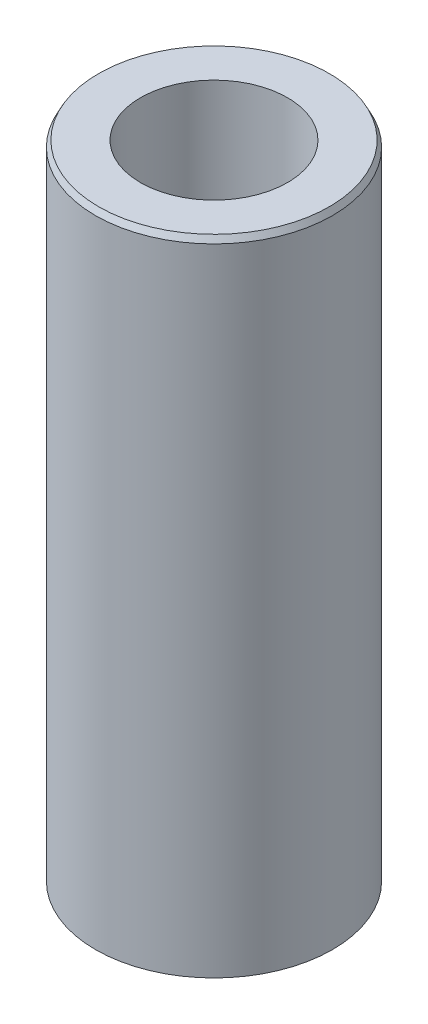
ISO-10303-21;
HEADER;
FILE_DESCRIPTION(('STEP AP214'),'2;1');
FILE_NAME('part.step','',(''),(''),'','','');
FILE_SCHEMA(('AUTOMOTIVE_DESIGN { 1 0 10303 214 1 1 1 1 }'));
ENDSEC;
DATA;
#1=APPLICATION_CONTEXT('core data for automotive mechanical design processes');
#2=APPLICATION_PROTOCOL_DEFINITION('international standard','automotive_design',2000,#1);
#3=PRODUCT_CONTEXT('',#1,'mechanical');
#4=PRODUCT('Part','Part','',(#3));
#5=PRODUCT_RELATED_PRODUCT_CATEGORY('part','',(#4));
#6=PRODUCT_DEFINITION_FORMATION('','',#4);
#7=PRODUCT_DEFINITION_CONTEXT('part definition',#1,'design');
#8=PRODUCT_DEFINITION('design','',#6,#7);
#9=PRODUCT_DEFINITION_SHAPE('','',#8);
#10=(LENGTH_UNIT() NAMED_UNIT(*) SI_UNIT(.MILLI.,.METRE.));
#11=(NAMED_UNIT(*) PLANE_ANGLE_UNIT() SI_UNIT($,.RADIAN.));
#12=(NAMED_UNIT(*) SI_UNIT($,.STERADIAN.) SOLID_ANGLE_UNIT());
#13=UNCERTAINTY_MEASURE_WITH_UNIT(LENGTH_MEASURE(1.E-05),#10,'distance_accuracy_value','');
#14=(GEOMETRIC_REPRESENTATION_CONTEXT(3) GLOBAL_UNCERTAINTY_ASSIGNED_CONTEXT((#13)) GLOBAL_UNIT_ASSIGNED_CONTEXT((#10,
#11,#12)) REPRESENTATION_CONTEXT('',''));
#15=CARTESIAN_POINT('',(0.,0.,0.));
#16=DIRECTION('',(0.,0.,1.));
#17=DIRECTION('',(1.,0.,0.));
#18=AXIS2_PLACEMENT_3D('',#15,#16,#17);
#19=CARTESIAN_POINT('',(0.,285.669680137574,0.));
#20=DIRECTION('',(0.,-1.,0.));
#21=DIRECTION('',(0.,0.,-1.));
#22=AXIS2_PLACEMENT_3D('',#19,#20,#21);
#23=CYLINDRICAL_SURFACE('',#22,52.5);
#24=CARTESIAN_POINT('',(0.,282.9644532507,0.));
#25=DIRECTION('',(0.,1.,0.));
#26=DIRECTION('',(0.,0.,1.));
#27=AXIS2_PLACEMENT_3D('',#24,#25,#26);
#28=CIRCLE('',#27,52.5);
#29=CARTESIAN_POINT('',(0.,282.9644532507,52.5));
#30=VERTEX_POINT('',#29);
#31=EDGE_CURVE('E50',#30,#30,#28,.F.);
#32=ORIENTED_EDGE('',*,*,#31,.T.);
#33=EDGE_LOOP('',(#32));
#34=FACE_BOUND('',#33,.T.);
#35=CARTESIAN_POINT('',(0.,1.40229356944427,0.));
#36=DIRECTION('',(0.,1.,0.));
#37=DIRECTION('',(0.,0.,1.));
#38=AXIS2_PLACEMENT_3D('',#35,#36,#37);
#39=CIRCLE('',#38,52.5);
#40=CARTESIAN_POINT('',(0.,1.40229356944427,52.5));
#41=VERTEX_POINT('',#40);
#42=EDGE_CURVE('E51',#41,#41,#39,.T.);
#43=ORIENTED_EDGE('',*,*,#42,.T.);
#44=EDGE_LOOP('',(#43));
#45=FACE_BOUND('',#44,.T.);
#46=ADVANCED_FACE('F39',(#34,#45),#23,.T.);
#47=CARTESIAN_POINT('',(0.,285.669680137574,0.));
#48=DIRECTION('',(0.,1.,0.));
#49=DIRECTION('',(0.,0.,1.));
#50=AXIS2_PLACEMENT_3D('',#47,#48,#49);
#51=PLANE('',#50);
#52=CARTESIAN_POINT('',(0.,285.669680137574,0.));
#53=DIRECTION('',(0.,1.,0.));
#54=DIRECTION('',(0.,0.,1.));
#55=AXIS2_PLACEMENT_3D('',#52,#53,#54);
#56=CIRCLE('',#55,51.0977064305557);
#57=CARTESIAN_POINT('',(0.,285.669680137574,51.0977064305557));
#58=VERTEX_POINT('',#57);
#59=EDGE_CURVE('E54',#58,#58,#56,.T.);
#60=ORIENTED_EDGE('',*,*,#59,.T.);
#61=EDGE_LOOP('',(#60));
#62=FACE_BOUND('',#61,.T.);
#63=CARTESIAN_POINT('',(0.,285.669680137574,0.));
#64=DIRECTION('',(0.,1.,0.));
#65=DIRECTION('',(0.,0.,1.));
#66=AXIS2_PLACEMENT_3D('',#63,#64,#65);
#67=CIRCLE('',#66,32.5802220716573);
#68=CARTESIAN_POINT('',(0.,285.669680137574,32.5802220716573));
#69=VERTEX_POINT('',#68);
#70=EDGE_CURVE('E58',#69,#69,#67,.T.);
#71=ORIENTED_EDGE('',*,*,#70,.F.);
#72=EDGE_LOOP('',(#71));
#73=FACE_BOUND('',#72,.T.);
#74=ADVANCED_FACE('F69',(#62,#73),#51,.T.);
#75=CARTESIAN_POINT('',(0.,0.,0.));
#76=DIRECTION('',(0.,1.,0.));
#77=DIRECTION('',(0.,0.,1.));
#78=AXIS2_PLACEMENT_3D('',#75,#76,#77);
#79=PLANE('',#78);
#80=CARTESIAN_POINT('',(0.,0.,0.));
#81=DIRECTION('',(0.,1.,0.));
#82=DIRECTION('',(0.,0.,1.));
#83=AXIS2_PLACEMENT_3D('',#80,#81,#82);
#84=CIRCLE('',#83,49.794773113126);
#85=CARTESIAN_POINT('',(0.,0.,49.794773113126));
#86=VERTEX_POINT('',#85);
#87=EDGE_CURVE('E10',#86,#86,#84,.F.);
#88=ORIENTED_EDGE('',*,*,#87,.T.);
#89=EDGE_LOOP('',(#88));
#90=FACE_BOUND('',#89,.T.);
#91=CARTESIAN_POINT('',(0.,0.,0.));
#92=DIRECTION('',(0.,1.,0.));
#93=DIRECTION('',(0.,0.,1.));
#94=AXIS2_PLACEMENT_3D('',#91,#92,#93);
#95=CIRCLE('',#94,32.5802220716573);
#96=CARTESIAN_POINT('',(0.,0.,32.5802220716573));
#97=VERTEX_POINT('',#96);
#98=EDGE_CURVE('E63',#97,#97,#95,.T.);
#99=ORIENTED_EDGE('',*,*,#98,.T.);
#100=EDGE_LOOP('',(#99));
#101=FACE_BOUND('',#100,.T.);
#102=ADVANCED_FACE('F75',(#90,#101),#79,.F.);
#103=CARTESIAN_POINT('',(0.,285.669680137574,0.));
#104=DIRECTION('',(0.,-1.,0.));
#105=DIRECTION('',(0.,0.,-1.));
#106=AXIS2_PLACEMENT_3D('',#103,#104,#105);
#107=CYLINDRICAL_SURFACE('',#106,32.5802220716573);
#108=ORIENTED_EDGE('',*,*,#70,.T.);
#109=EDGE_LOOP('',(#108));
#110=FACE_BOUND('',#109,.T.);
#111=ORIENTED_EDGE('',*,*,#98,.F.);
#112=EDGE_LOOP('',(#111));
#113=FACE_BOUND('',#112,.T.);
#114=ADVANCED_FACE('F70',(#110,#113),#107,.F.);
#115=CARTESIAN_POINT('',(0.,285.669680137574,0.));
#116=DIRECTION('',(0.,-1.,0.));
#117=DIRECTION('',(0.,0.,-1.));
#118=AXIS2_PLACEMENT_3D('',#115,#116,#117);
#119=CONICAL_SURFACE('',#118,51.0977064305557,0.478231036662319);
#120=ORIENTED_EDGE('',*,*,#31,.F.);
#121=EDGE_LOOP('',(#120));
#122=FACE_BOUND('',#121,.T.);
#123=ORIENTED_EDGE('',*,*,#59,.F.);
#124=EDGE_LOOP('',(#123));
#125=FACE_BOUND('',#124,.T.);
#126=ADVANCED_FACE('F81',(#122,#125),#119,.T.);
#127=CARTESIAN_POINT('',(0.,1.40229356944427,0.));
#128=DIRECTION('',(0.,1.,0.));
#129=DIRECTION('',(0.,0.,1.));
#130=AXIS2_PLACEMENT_3D('',#127,#128,#129);
#131=CONICAL_SURFACE('',#130,52.5,1.09256529013257);
#132=ORIENTED_EDGE('',*,*,#87,.F.);
#133=EDGE_LOOP('',(#132));
#134=FACE_BOUND('',#133,.T.);
#135=ORIENTED_EDGE('',*,*,#42,.F.);
#136=EDGE_LOOP('',(#135));
#137=FACE_BOUND('',#136,.T.);
#138=ADVANCED_FACE('F45',(#134,#137),#131,.T.);
#139=CLOSED_SHELL('',(#46,#74,#102,#114,#126,#138));
#140=MANIFOLD_SOLID_BREP('B2',#139);
#141=ADVANCED_BREP_SHAPE_REPRESENTATION('',(#18,#140),#14);
#142=SHAPE_DEFINITION_REPRESENTATION(#9,#141);
ENDSEC;
END-ISO-10303-21;
